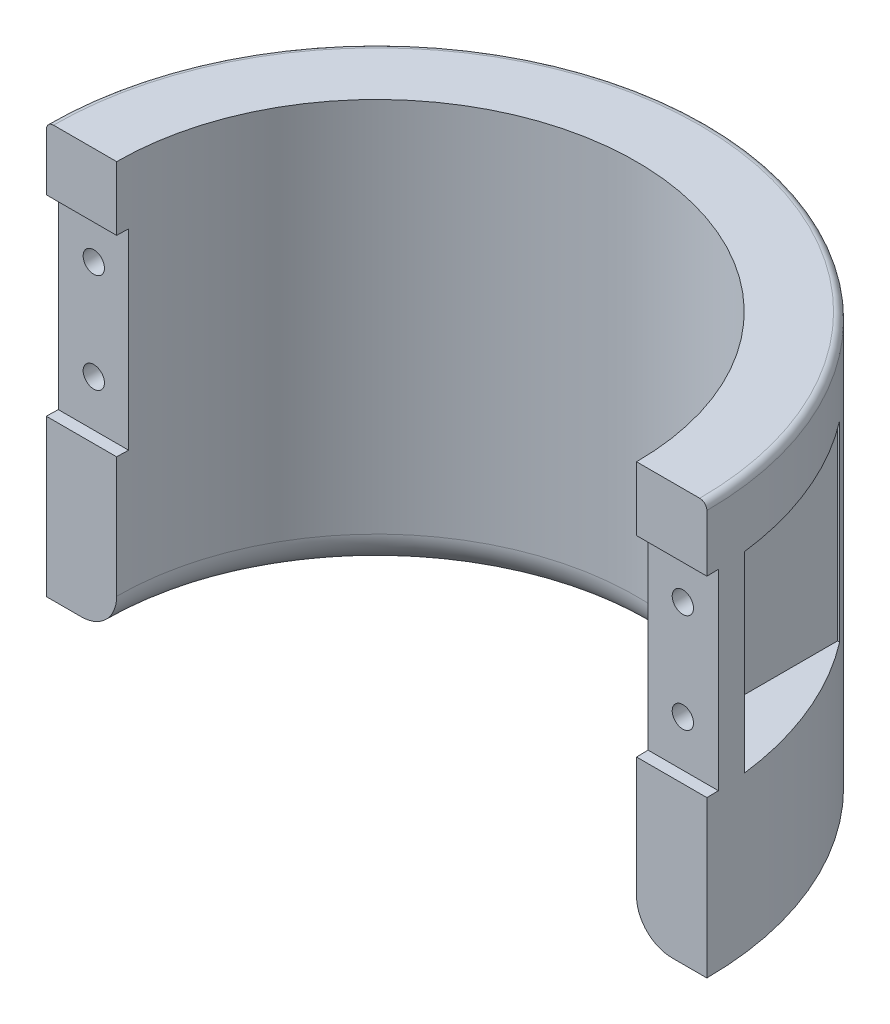
ISO-10303-21;
HEADER;
FILE_DESCRIPTION(('STEP AP214'),'2;1');
FILE_NAME('part.step','',(''),(''),'','','');
FILE_SCHEMA(('AUTOMOTIVE_DESIGN { 1 0 10303 214 1 1 1 1 }'));
ENDSEC;
DATA;
#1=APPLICATION_CONTEXT('core data for automotive mechanical design processes');
#2=APPLICATION_PROTOCOL_DEFINITION('international standard','automotive_design',2000,#1);
#3=PRODUCT_CONTEXT('',#1,'mechanical');
#4=PRODUCT('Part','Part','',(#3));
#5=PRODUCT_RELATED_PRODUCT_CATEGORY('part','',(#4));
#6=PRODUCT_DEFINITION_FORMATION('','',#4);
#7=PRODUCT_DEFINITION_CONTEXT('part definition',#1,'design');
#8=PRODUCT_DEFINITION('design','',#6,#7);
#9=PRODUCT_DEFINITION_SHAPE('','',#8);
#10=(LENGTH_UNIT() NAMED_UNIT(*) SI_UNIT(.MILLI.,.METRE.));
#11=(NAMED_UNIT(*) PLANE_ANGLE_UNIT() SI_UNIT($,.RADIAN.));
#12=(NAMED_UNIT(*) SI_UNIT($,.STERADIAN.) SOLID_ANGLE_UNIT());
#13=UNCERTAINTY_MEASURE_WITH_UNIT(LENGTH_MEASURE(1.E-05),#10,'distance_accuracy_value','');
#14=(GEOMETRIC_REPRESENTATION_CONTEXT(3) GLOBAL_UNCERTAINTY_ASSIGNED_CONTEXT((#13)) GLOBAL_UNIT_ASSIGNED_CONTEXT((#10,
#11,#12)) REPRESENTATION_CONTEXT('',''));
#15=CARTESIAN_POINT('',(0.,0.,0.));
#16=DIRECTION('',(0.,0.,1.));
#17=DIRECTION('',(1.,0.,0.));
#18=AXIS2_PLACEMENT_3D('',#15,#16,#17);
#19=CARTESIAN_POINT('',(41.4707165858242,42.5,-46.501));
#20=DIRECTION('',(0.,0.,1.));
#21=DIRECTION('',(1.,0.,0.));
#22=AXIS2_PLACEMENT_3D('',#19,#20,#21);
#23=CYLINDRICAL_SURFACE('',#22,1.5);
#24=CARTESIAN_POINT('',(41.4707165858242,42.5,-1.65));
#25=DIRECTION('',(0.,0.,-1.));
#26=DIRECTION('',(-1.,0.,0.));
#27=AXIS2_PLACEMENT_3D('',#24,#25,#26);
#28=CIRCLE('',#27,1.5);
#29=CARTESIAN_POINT('',(39.9707165858242,42.5,-1.65));
#30=VERTEX_POINT('',#29);
#31=EDGE_CURVE('E228',#30,#30,#28,.T.);
#32=ORIENTED_EDGE('',*,*,#31,.F.);
#33=EDGE_LOOP('',(#32));
#34=FACE_BOUND('',#33,.T.);
#35=CARTESIAN_POINT('',(41.4707165858242,42.5,-5.65));
#36=DIRECTION('',(0.,0.,-1.));
#37=DIRECTION('',(-1.,0.,0.));
#38=AXIS2_PLACEMENT_3D('',#35,#36,#37);
#39=CIRCLE('',#38,1.5);
#40=CARTESIAN_POINT('',(39.9707165858242,42.5,-5.65));
#41=VERTEX_POINT('',#40);
#42=EDGE_CURVE('E223',#41,#41,#39,.T.);
#43=ORIENTED_EDGE('',*,*,#42,.T.);
#44=EDGE_LOOP('',(#43));
#45=FACE_BOUND('',#44,.T.);
#46=ADVANCED_FACE('F37',(#34,#45),#23,.F.);
#47=CARTESIAN_POINT('',(41.4707165858242,28.5,-46.501));
#48=DIRECTION('',(0.,0.,1.));
#49=DIRECTION('',(1.,0.,0.));
#50=AXIS2_PLACEMENT_3D('',#47,#48,#49);
#51=CYLINDRICAL_SURFACE('',#50,1.5);
#52=CARTESIAN_POINT('',(41.4707165858242,28.5,-1.65));
#53=DIRECTION('',(0.,0.,-1.));
#54=DIRECTION('',(-1.,0.,0.));
#55=AXIS2_PLACEMENT_3D('',#52,#53,#54);
#56=CIRCLE('',#55,1.5);
#57=CARTESIAN_POINT('',(39.9707165858242,28.5,-1.65));
#58=VERTEX_POINT('',#57);
#59=EDGE_CURVE('E229',#58,#58,#56,.T.);
#60=ORIENTED_EDGE('',*,*,#59,.F.);
#61=EDGE_LOOP('',(#60));
#62=FACE_BOUND('',#61,.T.);
#63=CARTESIAN_POINT('',(41.4707165858242,28.5,-5.65));
#64=DIRECTION('',(0.,0.,-1.));
#65=DIRECTION('',(-1.,0.,0.));
#66=AXIS2_PLACEMENT_3D('',#63,#64,#65);
#67=CIRCLE('',#66,1.5);
#68=CARTESIAN_POINT('',(39.9707165858242,28.5,-5.65));
#69=VERTEX_POINT('',#68);
#70=EDGE_CURVE('E221',#69,#69,#67,.T.);
#71=ORIENTED_EDGE('',*,*,#70,.T.);
#72=EDGE_LOOP('',(#71));
#73=FACE_BOUND('',#72,.T.);
#74=ADVANCED_FACE('F414',(#62,#73),#51,.F.);
#75=CARTESIAN_POINT('',(0.,58.,0.));
#76=DIRECTION('',(0.,-1.,0.));
#77=DIRECTION('',(0.,0.,-1.));
#78=AXIS2_PLACEMENT_3D('',#75,#76,#77);
#79=CYLINDRICAL_SURFACE('',#78,46.5);
#80=CARTESIAN_POINT('',(0.,0.,0.));
#81=DIRECTION('',(0.,1.,0.));
#82=DIRECTION('',(0.,0.,1.));
#83=AXIS2_PLACEMENT_3D('',#80,#81,#82);
#84=CIRCLE('',#83,46.5);
#85=CARTESIAN_POINT('',(46.5,0.,0.));
#86=VERTEX_POINT('',#85);
#87=CARTESIAN_POINT('',(-46.5,0.,0.));
#88=VERTEX_POINT('',#87);
#89=EDGE_CURVE('E320',#86,#88,#84,.T.);
#90=ORIENTED_EDGE('',*,*,#89,.T.);
#91=DIRECTION('',(0.,-1.,0.));
#92=VECTOR('',#91,1.);
#93=CARTESIAN_POINT('',(-46.5,58.,0.));
#94=LINE('',#93,#92);
#95=CARTESIAN_POINT('',(-46.5,22.,0.));
#96=VERTEX_POINT('',#95);
#97=EDGE_CURVE('E327',#96,#88,#94,.T.);
#98=ORIENTED_EDGE('',*,*,#97,.F.);
#99=CARTESIAN_POINT('',(0.,22.,0.));
#100=DIRECTION('',(0.,-1.,0.));
#101=DIRECTION('',(0.,0.,-1.));
#102=AXIS2_PLACEMENT_3D('',#99,#100,#101);
#103=CIRCLE('',#102,46.5);
#104=CARTESIAN_POINT('',(-46.4707165858242,22.,-1.65));
#105=VERTEX_POINT('',#104);
#106=EDGE_CURVE('E292',#96,#105,#103,.T.);
#107=ORIENTED_EDGE('',*,*,#106,.T.);
#108=DIRECTION('',(0.,-1.,0.));
#109=VECTOR('',#108,1.);
#110=CARTESIAN_POINT('',(-46.4707165858242,58.,-1.65));
#111=LINE('',#110,#109);
#112=CARTESIAN_POINT('',(-46.4707165858242,49.,-1.65));
#113=VERTEX_POINT('',#112);
#114=EDGE_CURVE('E353',#105,#113,#111,.F.);
#115=ORIENTED_EDGE('',*,*,#114,.T.);
#116=CARTESIAN_POINT('',(0.,49.,0.));
#117=DIRECTION('',(0.,1.,0.));
#118=DIRECTION('',(0.,0.,1.));
#119=AXIS2_PLACEMENT_3D('',#116,#117,#118);
#120=CIRCLE('',#119,46.5);
#121=CARTESIAN_POINT('',(-46.5,49.,0.));
#122=VERTEX_POINT('',#121);
#123=EDGE_CURVE('E298',#113,#122,#120,.T.);
#124=ORIENTED_EDGE('',*,*,#123,.T.);
#125=CARTESIAN_POINT('',(-46.5,57.,0.));
#126=VERTEX_POINT('',#125);
#127=EDGE_CURVE('E328',#126,#122,#94,.T.);
#128=ORIENTED_EDGE('',*,*,#127,.F.);
#129=CARTESIAN_POINT('',(0.,57.,0.));
#130=DIRECTION('',(0.,1.,0.));
#131=DIRECTION('',(0.,0.,1.));
#132=AXIS2_PLACEMENT_3D('',#129,#130,#131);
#133=CIRCLE('',#132,46.5);
#134=CARTESIAN_POINT('',(46.5,57.,0.));
#135=VERTEX_POINT('',#134);
#136=EDGE_CURVE('E45',#126,#135,#133,.F.);
#137=ORIENTED_EDGE('',*,*,#136,.T.);
#138=DIRECTION('',(0.,-1.,0.));
#139=VECTOR('',#138,1.);
#140=CARTESIAN_POINT('',(46.5,58.,0.));
#141=LINE('',#140,#139);
#142=CARTESIAN_POINT('',(46.5,49.,0.));
#143=VERTEX_POINT('',#142);
#144=EDGE_CURVE('E331',#135,#143,#141,.T.);
#145=ORIENTED_EDGE('',*,*,#144,.T.);
#146=CARTESIAN_POINT('',(0.,49.,0.));
#147=DIRECTION('',(0.,-1.,0.));
#148=DIRECTION('',(0.,0.,-1.));
#149=AXIS2_PLACEMENT_3D('',#146,#147,#148);
#150=CIRCLE('',#149,46.5);
#151=CARTESIAN_POINT('',(46.4707165858242,49.,-1.65));
#152=VERTEX_POINT('',#151);
#153=EDGE_CURVE('E370',#152,#143,#150,.T.);
#154=ORIENTED_EDGE('',*,*,#153,.F.);
#155=DIRECTION('',(0.,-1.,0.));
#156=VECTOR('',#155,1.);
#157=CARTESIAN_POINT('',(46.4707165858242,58.,-1.65));
#158=LINE('',#157,#156);
#159=CARTESIAN_POINT('',(46.4707165858242,22.,-1.65));
#160=VERTEX_POINT('',#159);
#161=EDGE_CURVE('E367',#152,#160,#158,.T.);
#162=ORIENTED_EDGE('',*,*,#161,.T.);
#163=CARTESIAN_POINT('',(0.,22.,0.));
#164=DIRECTION('',(0.,1.,0.));
#165=DIRECTION('',(0.,0.,1.));
#166=AXIS2_PLACEMENT_3D('',#163,#164,#165);
#167=CIRCLE('',#166,46.5);
#168=CARTESIAN_POINT('',(46.5,22.,0.));
#169=VERTEX_POINT('',#168);
#170=EDGE_CURVE('E373',#169,#160,#167,.T.);
#171=ORIENTED_EDGE('',*,*,#170,.F.);
#172=EDGE_CURVE('E330',#169,#86,#141,.T.);
#173=ORIENTED_EDGE('',*,*,#172,.T.);
#174=EDGE_LOOP('',(#90,#98,#107,#115,#124,#128,#137,#145,#154,#162,#171,#173));
#175=FACE_BOUND('',#174,.T.);
#176=CARTESIAN_POINT('',(0.,49.,0.));
#177=DIRECTION('',(0.,-1.,0.));
#178=DIRECTION('',(0.,0.,-1.));
#179=AXIS2_PLACEMENT_3D('',#176,#177,#178);
#180=CIRCLE('',#179,46.5);
#181=CARTESIAN_POINT('',(36.8966123106173,49.,-28.3));
#182=VERTEX_POINT('',#181);
#183=CARTESIAN_POINT('',(46.1554709649896,49.,-5.65));
#184=VERTEX_POINT('',#183);
#185=EDGE_CURVE('E376',#182,#184,#180,.T.);
#186=ORIENTED_EDGE('',*,*,#185,.F.);
#187=DIRECTION('',(0.,-1.,0.));
#188=VECTOR('',#187,1.);
#189=CARTESIAN_POINT('',(36.8966123106173,58.,-28.3));
#190=LINE('',#189,#188);
#191=CARTESIAN_POINT('',(36.8966123106173,22.,-28.3));
#192=VERTEX_POINT('',#191);
#193=EDGE_CURVE('E208',#182,#192,#190,.T.);
#194=ORIENTED_EDGE('',*,*,#193,.T.);
#195=CARTESIAN_POINT('',(0.,22.,0.));
#196=DIRECTION('',(0.,1.,0.));
#197=DIRECTION('',(0.,0.,1.));
#198=AXIS2_PLACEMENT_3D('',#195,#196,#197);
#199=CIRCLE('',#198,46.5);
#200=CARTESIAN_POINT('',(46.1554709649896,22.,-5.65));
#201=VERTEX_POINT('',#200);
#202=EDGE_CURVE('E380',#201,#192,#199,.T.);
#203=ORIENTED_EDGE('',*,*,#202,.F.);
#204=DIRECTION('',(0.,-1.,0.));
#205=VECTOR('',#204,1.);
#206=CARTESIAN_POINT('',(46.1554709649896,58.,-5.65));
#207=LINE('',#206,#205);
#208=EDGE_CURVE('E226',#184,#201,#207,.T.);
#209=ORIENTED_EDGE('',*,*,#208,.F.);
#210=EDGE_LOOP('',(#186,#194,#203,#209));
#211=FACE_BOUND('',#210,.T.);
#212=CARTESIAN_POINT('',(0.,22.,0.));
#213=DIRECTION('',(0.,-1.,0.));
#214=DIRECTION('',(0.,0.,-1.));
#215=AXIS2_PLACEMENT_3D('',#212,#213,#214);
#216=CIRCLE('',#215,46.5);
#217=CARTESIAN_POINT('',(-46.1554709649896,22.,-5.65));
#218=VERTEX_POINT('',#217);
#219=CARTESIAN_POINT('',(-36.8966123106173,22.,-28.3));
#220=VERTEX_POINT('',#219);
#221=EDGE_CURVE('E356',#218,#220,#216,.T.);
#222=ORIENTED_EDGE('',*,*,#221,.T.);
#223=DIRECTION('',(0.,-1.,0.));
#224=VECTOR('',#223,1.);
#225=CARTESIAN_POINT('',(-36.8966123106173,58.,-28.3));
#226=LINE('',#225,#224);
#227=CARTESIAN_POINT('',(-36.8966123106173,49.,-28.3));
#228=VERTEX_POINT('',#227);
#229=EDGE_CURVE('E364',#220,#228,#226,.F.);
#230=ORIENTED_EDGE('',*,*,#229,.T.);
#231=CARTESIAN_POINT('',(0.,49.,0.));
#232=DIRECTION('',(0.,1.,0.));
#233=DIRECTION('',(0.,0.,1.));
#234=AXIS2_PLACEMENT_3D('',#231,#232,#233);
#235=CIRCLE('',#234,46.5);
#236=CARTESIAN_POINT('',(-46.1554709649896,49.,-5.65));
#237=VERTEX_POINT('',#236);
#238=EDGE_CURVE('E361',#228,#237,#235,.T.);
#239=ORIENTED_EDGE('',*,*,#238,.T.);
#240=DIRECTION('',(0.,-1.,0.));
#241=VECTOR('',#240,1.);
#242=CARTESIAN_POINT('',(-46.1554709649896,58.,-5.65));
#243=LINE('',#242,#241);
#244=EDGE_CURVE('E278',#218,#237,#243,.F.);
#245=ORIENTED_EDGE('',*,*,#244,.F.);
#246=EDGE_LOOP('',(#222,#230,#239,#245));
#247=FACE_BOUND('',#246,.T.);
#248=ADVANCED_FACE('F421',(#175,#211,#247),#79,.T.);
#249=CARTESIAN_POINT('',(0.,58.,0.));
#250=DIRECTION('',(0.,-1.,0.));
#251=DIRECTION('',(0.,0.,-1.));
#252=AXIS2_PLACEMENT_3D('',#249,#250,#251);
#253=CYLINDRICAL_SURFACE('',#252,36.6);
#254=CARTESIAN_POINT('',(0.,22.,0.));
#255=DIRECTION('',(0.,1.,0.));
#256=DIRECTION('',(0.,0.,1.));
#257=AXIS2_PLACEMENT_3D('',#254,#255,#256);
#258=CIRCLE('',#257,36.6);
#259=CARTESIAN_POINT('',(36.5627884604005,22.,-1.65));
#260=VERTEX_POINT('',#259);
#261=CARTESIAN_POINT('',(36.6,22.,0.));
#262=VERTEX_POINT('',#261);
#263=EDGE_CURVE('E251',#260,#262,#258,.F.);
#264=ORIENTED_EDGE('',*,*,#263,.F.);
#265=DIRECTION('',(0.,-1.,0.));
#266=VECTOR('',#265,1.);
#267=CARTESIAN_POINT('',(36.5627884604005,58.,-1.65));
#268=LINE('',#267,#266);
#269=CARTESIAN_POINT('',(36.5627884604005,49.,-1.65));
#270=VERTEX_POINT('',#269);
#271=EDGE_CURVE('E242',#260,#270,#268,.F.);
#272=ORIENTED_EDGE('',*,*,#271,.T.);
#273=CARTESIAN_POINT('',(0.,49.,0.));
#274=DIRECTION('',(0.,-1.,0.));
#275=DIRECTION('',(0.,0.,-1.));
#276=AXIS2_PLACEMENT_3D('',#273,#274,#275);
#277=CIRCLE('',#276,36.6);
#278=CARTESIAN_POINT('',(36.6,49.,0.));
#279=VERTEX_POINT('',#278);
#280=EDGE_CURVE('E249',#279,#270,#277,.F.);
#281=ORIENTED_EDGE('',*,*,#280,.F.);
#282=DIRECTION('',(0.,-1.,0.));
#283=VECTOR('',#282,1.);
#284=CARTESIAN_POINT('',(36.6,58.,0.));
#285=LINE('',#284,#283);
#286=CARTESIAN_POINT('',(36.6,58.,0.));
#287=VERTEX_POINT('',#286);
#288=EDGE_CURVE('E334',#287,#279,#285,.T.);
#289=ORIENTED_EDGE('',*,*,#288,.F.);
#290=CARTESIAN_POINT('',(0.,58.,0.));
#291=DIRECTION('',(0.,-1.,0.));
#292=DIRECTION('',(0.,0.,1.));
#293=AXIS2_PLACEMENT_3D('',#290,#291,#292);
#294=CIRCLE('',#293,36.6);
#295=CARTESIAN_POINT('',(-36.6,58.,0.));
#296=VERTEX_POINT('',#295);
#297=EDGE_CURVE('E308',#296,#287,#294,.T.);
#298=ORIENTED_EDGE('',*,*,#297,.F.);
#299=DIRECTION('',(0.,-1.,0.));
#300=VECTOR('',#299,1.);
#301=CARTESIAN_POINT('',(-36.6,58.,0.));
#302=LINE('',#301,#300);
#303=CARTESIAN_POINT('',(-36.6,49.,0.));
#304=VERTEX_POINT('',#303);
#305=EDGE_CURVE('E324',#296,#304,#302,.T.);
#306=ORIENTED_EDGE('',*,*,#305,.T.);
#307=CARTESIAN_POINT('',(0.,49.,0.));
#308=DIRECTION('',(0.,1.,0.));
#309=DIRECTION('',(0.,0.,1.));
#310=AXIS2_PLACEMENT_3D('',#307,#308,#309);
#311=CIRCLE('',#310,36.6);
#312=CARTESIAN_POINT('',(-36.5627884604005,49.,-1.65));
#313=VERTEX_POINT('',#312);
#314=EDGE_CURVE('E301',#304,#313,#311,.F.);
#315=ORIENTED_EDGE('',*,*,#314,.T.);
#316=DIRECTION('',(0.,-1.,0.));
#317=VECTOR('',#316,1.);
#318=CARTESIAN_POINT('',(-36.5627884604005,58.,-1.65));
#319=LINE('',#318,#317);
#320=CARTESIAN_POINT('',(-36.5627884604005,22.,-1.65));
#321=VERTEX_POINT('',#320);
#322=EDGE_CURVE('E304',#313,#321,#319,.T.);
#323=ORIENTED_EDGE('',*,*,#322,.T.);
#324=CARTESIAN_POINT('',(0.,22.,0.));
#325=DIRECTION('',(0.,-1.,0.));
#326=DIRECTION('',(0.,0.,-1.));
#327=AXIS2_PLACEMENT_3D('',#324,#325,#326);
#328=CIRCLE('',#327,36.6);
#329=CARTESIAN_POINT('',(-36.6,22.,0.));
#330=VERTEX_POINT('',#329);
#331=EDGE_CURVE('E295',#321,#330,#328,.F.);
#332=ORIENTED_EDGE('',*,*,#331,.T.);
#333=CARTESIAN_POINT('',(-36.6,5.00000000000001,0.));
#334=VERTEX_POINT('',#333);
#335=EDGE_CURVE('E317',#330,#334,#302,.T.);
#336=ORIENTED_EDGE('',*,*,#335,.T.);
#337=CARTESIAN_POINT('',(0.,5.,0.));
#338=DIRECTION('',(0.,1.,0.));
#339=DIRECTION('',(0.,0.,1.));
#340=AXIS2_PLACEMENT_3D('',#337,#338,#339);
#341=CIRCLE('',#340,36.6);
#342=CARTESIAN_POINT('',(36.6,5.00000000000001,0.));
#343=VERTEX_POINT('',#342);
#344=EDGE_CURVE('E337',#334,#343,#341,.F.);
#345=ORIENTED_EDGE('',*,*,#344,.T.);
#346=EDGE_CURVE('E333',#262,#343,#285,.T.);
#347=ORIENTED_EDGE('',*,*,#346,.F.);
#348=EDGE_LOOP('',(#264,#272,#281,#289,#298,#306,#315,#323,#332,#336,#345,#347));
#349=FACE_BOUND('',#348,.T.);
#350=ADVANCED_FACE('F398',(#349),#253,.F.);
#351=CARTESIAN_POINT('',(36.6,58.,0.));
#352=DIRECTION('',(0.,0.,-1.));
#353=DIRECTION('',(-1.,0.,0.));
#354=AXIS2_PLACEMENT_3D('',#351,#352,#353);
#355=PLANE('',#354);
#356=DIRECTION('',(-1.,0.,0.));
#357=VECTOR('',#356,1.);
#358=CARTESIAN_POINT('',(48.2491093819212,22.,0.));
#359=LINE('',#358,#357);
#360=EDGE_CURVE('E239',#169,#262,#359,.T.);
#361=ORIENTED_EDGE('',*,*,#360,.T.);
#362=ORIENTED_EDGE('',*,*,#346,.T.);
#363=CARTESIAN_POINT('',(41.6,5.,0.));
#364=DIRECTION('',(0.,0.,-1.));
#365=DIRECTION('',(-1.,0.,0.));
#366=AXIS2_PLACEMENT_3D('',#363,#364,#365);
#367=CIRCLE('',#366,5.);
#368=CARTESIAN_POINT('',(41.6,0.,0.));
#369=VERTEX_POINT('',#368);
#370=EDGE_CURVE('E340',#343,#369,#367,.F.);
#371=ORIENTED_EDGE('',*,*,#370,.T.);
#372=DIRECTION('',(1.,0.,0.));
#373=VECTOR('',#372,1.);
#374=CARTESIAN_POINT('',(36.6,0.,0.));
#375=LINE('',#374,#373);
#376=EDGE_CURVE('E307',#369,#86,#375,.T.);
#377=ORIENTED_EDGE('',*,*,#376,.T.);
#378=ORIENTED_EDGE('',*,*,#172,.F.);
#379=EDGE_LOOP('',(#361,#362,#371,#377,#378));
#380=FACE_BOUND('',#379,.T.);
#381=ADVANCED_FACE('F494',(#380),#355,.F.);
#382=ORIENTED_EDGE('',*,*,#144,.F.);
#383=CARTESIAN_POINT('',(45.5,57.,0.));
#384=DIRECTION('',(0.,0.,-1.));
#385=DIRECTION('',(-1.,0.,0.));
#386=AXIS2_PLACEMENT_3D('',#383,#384,#385);
#387=CIRCLE('',#386,1.);
#388=CARTESIAN_POINT('',(45.5,58.,0.));
#389=VERTEX_POINT('',#388);
#390=EDGE_CURVE('E11',#135,#389,#387,.F.);
#391=ORIENTED_EDGE('',*,*,#390,.T.);
#392=DIRECTION('',(1.,0.,0.));
#393=VECTOR('',#392,1.);
#394=CARTESIAN_POINT('',(36.6,58.,0.));
#395=LINE('',#394,#393);
#396=EDGE_CURVE('E311',#287,#389,#395,.T.);
#397=ORIENTED_EDGE('',*,*,#396,.F.);
#398=ORIENTED_EDGE('',*,*,#288,.T.);
#399=DIRECTION('',(1.,0.,0.));
#400=VECTOR('',#399,1.);
#401=CARTESIAN_POINT('',(48.2491093819212,49.,0.));
#402=LINE('',#401,#400);
#403=EDGE_CURVE('E232',#279,#143,#402,.T.);
#404=ORIENTED_EDGE('',*,*,#403,.T.);
#405=EDGE_LOOP('',(#382,#391,#397,#398,#404));
#406=FACE_BOUND('',#405,.T.);
#407=ADVANCED_FACE('F401',(#406),#355,.F.);
#408=CARTESIAN_POINT('',(-41.4707165858242,42.5,-46.501));
#409=DIRECTION('',(0.,0.,1.));
#410=DIRECTION('',(1.,0.,0.));
#411=AXIS2_PLACEMENT_3D('',#408,#409,#410);
#412=CYLINDRICAL_SURFACE('',#411,1.5);
#413=CARTESIAN_POINT('',(-41.4707165858242,42.5,-1.65));
#414=DIRECTION('',(0.,0.,1.));
#415=DIRECTION('',(1.,0.,0.));
#416=AXIS2_PLACEMENT_3D('',#413,#414,#415);
#417=CIRCLE('',#416,1.5);
#418=CARTESIAN_POINT('',(-39.9707165858242,42.5,-1.65));
#419=VERTEX_POINT('',#418);
#420=EDGE_CURVE('E280',#419,#419,#417,.T.);
#421=ORIENTED_EDGE('',*,*,#420,.T.);
#422=EDGE_LOOP('',(#421));
#423=FACE_BOUND('',#422,.T.);
#424=CARTESIAN_POINT('',(-41.4707165858242,42.5,-5.65));
#425=DIRECTION('',(0.,0.,-1.));
#426=DIRECTION('',(-1.,0.,0.));
#427=AXIS2_PLACEMENT_3D('',#424,#425,#426);
#428=CIRCLE('',#427,1.5);
#429=CARTESIAN_POINT('',(-42.9707165858242,42.5,-5.65));
#430=VERTEX_POINT('',#429);
#431=EDGE_CURVE('E275',#430,#430,#428,.F.);
#432=ORIENTED_EDGE('',*,*,#431,.F.);
#433=EDGE_LOOP('',(#432));
#434=FACE_BOUND('',#433,.T.);
#435=ADVANCED_FACE('F465',(#423,#434),#412,.F.);
#436=CARTESIAN_POINT('',(-41.4707165858242,28.5,-46.501));
#437=DIRECTION('',(0.,0.,1.));
#438=DIRECTION('',(1.,0.,0.));
#439=AXIS2_PLACEMENT_3D('',#436,#437,#438);
#440=CYLINDRICAL_SURFACE('',#439,1.5);
#441=CARTESIAN_POINT('',(-41.4707165858242,28.5,-1.65));
#442=DIRECTION('',(0.,0.,1.));
#443=DIRECTION('',(1.,0.,0.));
#444=AXIS2_PLACEMENT_3D('',#441,#442,#443);
#445=CIRCLE('',#444,1.5);
#446=CARTESIAN_POINT('',(-39.9707165858242,28.5,-1.65));
#447=VERTEX_POINT('',#446);
#448=EDGE_CURVE('E281',#447,#447,#445,.T.);
#449=ORIENTED_EDGE('',*,*,#448,.T.);
#450=EDGE_LOOP('',(#449));
#451=FACE_BOUND('',#450,.T.);
#452=CARTESIAN_POINT('',(-41.4707165858242,28.5,-5.65));
#453=DIRECTION('',(0.,0.,-1.));
#454=DIRECTION('',(-1.,0.,0.));
#455=AXIS2_PLACEMENT_3D('',#452,#453,#454);
#456=CIRCLE('',#455,1.5);
#457=CARTESIAN_POINT('',(-42.9707165858242,28.5,-5.65));
#458=VERTEX_POINT('',#457);
#459=EDGE_CURVE('E272',#458,#458,#456,.F.);
#460=ORIENTED_EDGE('',*,*,#459,.F.);
#461=EDGE_LOOP('',(#460));
#462=FACE_BOUND('',#461,.T.);
#463=ADVANCED_FACE('F462',(#451,#462),#440,.F.);
#464=CARTESIAN_POINT('',(-46.5,58.,0.));
#465=DIRECTION('',(0.,0.,-1.));
#466=DIRECTION('',(-1.,0.,0.));
#467=AXIS2_PLACEMENT_3D('',#464,#465,#466);
#468=PLANE('',#467);
#469=DIRECTION('',(1.,0.,0.));
#470=VECTOR('',#469,1.);
#471=CARTESIAN_POINT('',(-46.5,58.,0.));
#472=LINE('',#471,#470);
#473=CARTESIAN_POINT('',(-45.5,58.,0.));
#474=VERTEX_POINT('',#473);
#475=EDGE_CURVE('E315',#474,#296,#472,.T.);
#476=ORIENTED_EDGE('',*,*,#475,.F.);
#477=CARTESIAN_POINT('',(-45.5,57.,0.));
#478=DIRECTION('',(0.,0.,-1.));
#479=DIRECTION('',(-1.,0.,0.));
#480=AXIS2_PLACEMENT_3D('',#477,#478,#479);
#481=CIRCLE('',#480,1.);
#482=EDGE_CURVE('E59',#474,#126,#481,.F.);
#483=ORIENTED_EDGE('',*,*,#482,.T.);
#484=ORIENTED_EDGE('',*,*,#127,.T.);
#485=DIRECTION('',(1.,0.,0.));
#486=VECTOR('',#485,1.);
#487=CARTESIAN_POINT('',(-46.5,49.,0.));
#488=LINE('',#487,#486);
#489=EDGE_CURVE('E350',#122,#304,#488,.T.);
#490=ORIENTED_EDGE('',*,*,#489,.T.);
#491=ORIENTED_EDGE('',*,*,#305,.F.);
#492=EDGE_LOOP('',(#476,#483,#484,#490,#491));
#493=FACE_BOUND('',#492,.T.);
#494=ADVANCED_FACE('F392',(#493),#468,.F.);
#495=ORIENTED_EDGE('',*,*,#335,.F.);
#496=DIRECTION('',(-1.,0.,0.));
#497=VECTOR('',#496,1.);
#498=CARTESIAN_POINT('',(-46.5,22.,0.));
#499=LINE('',#498,#497);
#500=EDGE_CURVE('E347',#330,#96,#499,.T.);
#501=ORIENTED_EDGE('',*,*,#500,.T.);
#502=ORIENTED_EDGE('',*,*,#97,.T.);
#503=DIRECTION('',(1.,0.,0.));
#504=VECTOR('',#503,1.);
#505=CARTESIAN_POINT('',(-46.5,0.,0.));
#506=LINE('',#505,#504);
#507=CARTESIAN_POINT('',(-41.6,0.,0.));
#508=VERTEX_POINT('',#507);
#509=EDGE_CURVE('E312',#88,#508,#506,.T.);
#510=ORIENTED_EDGE('',*,*,#509,.T.);
#511=CARTESIAN_POINT('',(-41.6,5.,0.));
#512=DIRECTION('',(0.,0.,-1.));
#513=DIRECTION('',(-1.,0.,0.));
#514=AXIS2_PLACEMENT_3D('',#511,#512,#513);
#515=CIRCLE('',#514,5.);
#516=EDGE_CURVE('E344',#508,#334,#515,.F.);
#517=ORIENTED_EDGE('',*,*,#516,.T.);
#518=EDGE_LOOP('',(#495,#501,#502,#510,#517));
#519=FACE_BOUND('',#518,.T.);
#520=ADVANCED_FACE('F485',(#519),#468,.F.);
#521=CARTESIAN_POINT('',(0.,58.,0.));
#522=DIRECTION('',(0.,1.,0.));
#523=DIRECTION('',(0.,0.,1.));
#524=AXIS2_PLACEMENT_3D('',#521,#522,#523);
#525=PLANE('',#524);
#526=ORIENTED_EDGE('',*,*,#396,.T.);
#527=CARTESIAN_POINT('',(0.,58.,0.));
#528=DIRECTION('',(0.,1.,0.));
#529=DIRECTION('',(0.,0.,1.));
#530=AXIS2_PLACEMENT_3D('',#527,#528,#529);
#531=CIRCLE('',#530,45.5);
#532=EDGE_CURVE('E383',#389,#474,#531,.T.);
#533=ORIENTED_EDGE('',*,*,#532,.T.);
#534=ORIENTED_EDGE('',*,*,#475,.T.);
#535=ORIENTED_EDGE('',*,*,#297,.T.);
#536=EDGE_LOOP('',(#526,#533,#534,#535));
#537=FACE_BOUND('',#536,.T.);
#538=ADVANCED_FACE('F388',(#537),#525,.T.);
#539=CARTESIAN_POINT('',(0.,0.,0.));
#540=DIRECTION('',(0.,1.,0.));
#541=DIRECTION('',(0.,0.,1.));
#542=AXIS2_PLACEMENT_3D('',#539,#540,#541);
#543=PLANE('',#542);
#544=CARTESIAN_POINT('',(-42.3220149751344,0.,-13.751256249685));
#545=DIRECTION('',(0.,-1.,0.));
#546=DIRECTION('',(-0.951056516295155,0.,-0.309016994374945));
#547=AXIS2_PLACEMENT_3D('',#544,#545,#546);
#548=CIRCLE('',#547,1.);
#549=CARTESIAN_POINT('',(-43.2730714914295,0.,-14.06027324406));
#550=VERTEX_POINT('',#549);
#551=EDGE_CURVE('E573',#550,#550,#548,.T.);
#552=ORIENTED_EDGE('',*,*,#551,.F.);
#553=EDGE_LOOP('',(#552));
#554=FACE_BOUND('',#553,.T.);
#555=CARTESIAN_POINT('',(42.3220149751342,0.,-13.7512562496856));
#556=DIRECTION('',(0.,-1.,0.));
#557=DIRECTION('',(0.95105651629515,0.,-0.309016994374958));
#558=AXIS2_PLACEMENT_3D('',#555,#556,#557);
#559=CIRCLE('',#558,1.);
#560=CARTESIAN_POINT('',(43.2730714914293,0.,-14.0602732440606));
#561=VERTEX_POINT('',#560);
#562=EDGE_CURVE('E582',#561,#561,#559,.T.);
#563=ORIENTED_EDGE('',*,*,#562,.F.);
#564=EDGE_LOOP('',(#563));
#565=FACE_BOUND('',#564,.T.);
#566=CARTESIAN_POINT('',(0.,0.,-44.5));
#567=DIRECTION('',(0.,-1.,0.));
#568=DIRECTION('',(0.,0.,-1.));
#569=AXIS2_PLACEMENT_3D('',#566,#567,#568);
#570=CIRCLE('',#569,1.);
#571=CARTESIAN_POINT('',(0.,0.,-45.5));
#572=VERTEX_POINT('',#571);
#573=EDGE_CURVE('E214',#572,#572,#570,.T.);
#574=ORIENTED_EDGE('',*,*,#573,.F.);
#575=EDGE_LOOP('',(#574));
#576=FACE_BOUND('',#575,.T.);
#577=ORIENTED_EDGE('',*,*,#509,.F.);
#578=ORIENTED_EDGE('',*,*,#89,.F.);
#579=ORIENTED_EDGE('',*,*,#376,.F.);
#580=CARTESIAN_POINT('',(0.,0.,0.));
#581=DIRECTION('',(0.,1.,0.));
#582=DIRECTION('',(0.,0.,1.));
#583=AXIS2_PLACEMENT_3D('',#580,#581,#582);
#584=CIRCLE('',#583,41.6);
#585=EDGE_CURVE('E342',#369,#508,#584,.T.);
#586=ORIENTED_EDGE('',*,*,#585,.T.);
#587=EDGE_LOOP('',(#577,#578,#579,#586));
#588=FACE_BOUND('',#587,.T.);
#589=ADVANCED_FACE('F484',(#554,#565,#576,#588),#543,.F.);
#590=CARTESIAN_POINT('',(0.,5.,0.));
#591=DIRECTION('',(0.,1.,0.));
#592=DIRECTION('',(0.,0.,1.));
#593=AXIS2_PLACEMENT_3D('',#590,#591,#592);
#594=TOROIDAL_SURFACE('',#593,41.6,5.);
#595=ORIENTED_EDGE('',*,*,#516,.F.);
#596=ORIENTED_EDGE('',*,*,#585,.F.);
#597=ORIENTED_EDGE('',*,*,#370,.F.);
#598=ORIENTED_EDGE('',*,*,#344,.F.);
#599=EDGE_LOOP('',(#595,#596,#597,#598));
#600=FACE_BOUND('',#599,.T.);
#601=ADVANCED_FACE('F474',(#600),#594,.T.);
#602=CARTESIAN_POINT('',(0.,0.,-1.65));
#603=DIRECTION('',(0.,0.,-1.));
#604=DIRECTION('',(-1.,0.,0.));
#605=AXIS2_PLACEMENT_3D('',#602,#603,#604);
#606=PLANE('',#605);
#607=ORIENTED_EDGE('',*,*,#448,.F.);
#608=EDGE_LOOP('',(#607));
#609=FACE_BOUND('',#608,.T.);
#610=ORIENTED_EDGE('',*,*,#420,.F.);
#611=EDGE_LOOP('',(#610));
#612=FACE_BOUND('',#611,.T.);
#613=DIRECTION('',(-1.,0.,0.));
#614=VECTOR('',#613,1.);
#615=CARTESIAN_POINT('',(-48.2491093819212,49.,-1.65));
#616=LINE('',#615,#614);
#617=EDGE_CURVE('E289',#313,#113,#616,.T.);
#618=ORIENTED_EDGE('',*,*,#617,.T.);
#619=ORIENTED_EDGE('',*,*,#114,.F.);
#620=DIRECTION('',(1.,0.,0.));
#621=VECTOR('',#620,1.);
#622=CARTESIAN_POINT('',(-48.2491093819212,22.,-1.65));
#623=LINE('',#622,#621);
#624=EDGE_CURVE('E284',#105,#321,#623,.T.);
#625=ORIENTED_EDGE('',*,*,#624,.T.);
#626=ORIENTED_EDGE('',*,*,#322,.F.);
#627=EDGE_LOOP('',(#618,#619,#625,#626));
#628=FACE_BOUND('',#627,.T.);
#629=ADVANCED_FACE('F470',(#609,#612,#628),#606,.F.);
#630=CARTESIAN_POINT('',(-48.2491093819212,49.,-1.65));
#631=DIRECTION('',(0.,1.,0.));
#632=DIRECTION('',(0.,0.,1.));
#633=AXIS2_PLACEMENT_3D('',#630,#631,#632);
#634=PLANE('',#633);
#635=ORIENTED_EDGE('',*,*,#489,.F.);
#636=ORIENTED_EDGE('',*,*,#123,.F.);
#637=ORIENTED_EDGE('',*,*,#617,.F.);
#638=ORIENTED_EDGE('',*,*,#314,.F.);
#639=EDGE_LOOP('',(#635,#636,#637,#638));
#640=FACE_BOUND('',#639,.T.);
#641=ADVANCED_FACE('F473',(#640),#634,.F.);
#642=CARTESIAN_POINT('',(-48.2491093819212,22.,-1.65));
#643=DIRECTION('',(0.,-1.,0.));
#644=DIRECTION('',(0.,0.,-1.));
#645=AXIS2_PLACEMENT_3D('',#642,#643,#644);
#646=PLANE('',#645);
#647=ORIENTED_EDGE('',*,*,#624,.F.);
#648=ORIENTED_EDGE('',*,*,#106,.F.);
#649=ORIENTED_EDGE('',*,*,#500,.F.);
#650=ORIENTED_EDGE('',*,*,#331,.F.);
#651=EDGE_LOOP('',(#647,#648,#649,#650));
#652=FACE_BOUND('',#651,.T.);
#653=ADVANCED_FACE('F454',(#652),#646,.F.);
#654=CARTESIAN_POINT('',(-46.5,49.,-28.3));
#655=DIRECTION('',(0.,1.,0.));
#656=DIRECTION('',(0.,0.,1.));
#657=AXIS2_PLACEMENT_3D('',#654,#655,#656);
#658=PLANE('',#657);
#659=DIRECTION('',(-1.,0.,0.));
#660=VECTOR('',#659,1.);
#661=CARTESIAN_POINT('',(-46.5,49.,-28.3));
#662=LINE('',#661,#660);
#663=CARTESIAN_POINT('',(-36.6,49.,-28.3));
#664=VERTEX_POINT('',#663);
#665=EDGE_CURVE('E260',#664,#228,#662,.T.);
#666=ORIENTED_EDGE('',*,*,#665,.F.);
#667=DIRECTION('',(0.,0.,1.));
#668=VECTOR('',#667,1.);
#669=CARTESIAN_POINT('',(-36.6,49.,-28.3));
#670=LINE('',#669,#668);
#671=CARTESIAN_POINT('',(-36.6,49.,-5.65));
#672=VERTEX_POINT('',#671);
#673=EDGE_CURVE('E270',#664,#672,#670,.T.);
#674=ORIENTED_EDGE('',*,*,#673,.T.);
#675=DIRECTION('',(-1.,0.,0.));
#676=VECTOR('',#675,1.);
#677=CARTESIAN_POINT('',(-46.5,49.,-5.65));
#678=LINE('',#677,#676);
#679=EDGE_CURVE('E257',#672,#237,#678,.T.);
#680=ORIENTED_EDGE('',*,*,#679,.T.);
#681=ORIENTED_EDGE('',*,*,#238,.F.);
#682=EDGE_LOOP('',(#666,#674,#680,#681));
#683=FACE_BOUND('',#682,.T.);
#684=ADVANCED_FACE('F451',(#683),#658,.F.);
#685=CARTESIAN_POINT('',(-46.5,22.,-28.3));
#686=DIRECTION('',(0.,-1.,0.));
#687=DIRECTION('',(0.,0.,-1.));
#688=AXIS2_PLACEMENT_3D('',#685,#686,#687);
#689=PLANE('',#688);
#690=DIRECTION('',(1.,0.,0.));
#691=VECTOR('',#690,1.);
#692=CARTESIAN_POINT('',(-46.5,22.,-5.65));
#693=LINE('',#692,#691);
#694=CARTESIAN_POINT('',(-36.6,22.,-5.65));
#695=VERTEX_POINT('',#694);
#696=EDGE_CURVE('E253',#218,#695,#693,.T.);
#697=ORIENTED_EDGE('',*,*,#696,.T.);
#698=DIRECTION('',(0.,0.,1.));
#699=VECTOR('',#698,1.);
#700=CARTESIAN_POINT('',(-36.6,22.,-28.3));
#701=LINE('',#700,#699);
#702=CARTESIAN_POINT('',(-36.6,22.,-28.3));
#703=VERTEX_POINT('',#702);
#704=EDGE_CURVE('E263',#703,#695,#701,.T.);
#705=ORIENTED_EDGE('',*,*,#704,.F.);
#706=DIRECTION('',(1.,0.,0.));
#707=VECTOR('',#706,1.);
#708=CARTESIAN_POINT('',(-46.5,22.,-28.3));
#709=LINE('',#708,#707);
#710=EDGE_CURVE('E254',#220,#703,#709,.T.);
#711=ORIENTED_EDGE('',*,*,#710,.F.);
#712=ORIENTED_EDGE('',*,*,#221,.F.);
#713=EDGE_LOOP('',(#697,#705,#711,#712));
#714=FACE_BOUND('',#713,.T.);
#715=ADVANCED_FACE('F446',(#714),#689,.F.);
#716=CARTESIAN_POINT('',(0.,0.,-28.3));
#717=DIRECTION('',(0.,0.,-1.));
#718=DIRECTION('',(-1.,0.,0.));
#719=AXIS2_PLACEMENT_3D('',#716,#717,#718);
#720=PLANE('',#719);
#721=ORIENTED_EDGE('',*,*,#710,.T.);
#722=DIRECTION('',(0.,1.,0.));
#723=VECTOR('',#722,1.);
#724=CARTESIAN_POINT('',(-36.6,22.,-28.3));
#725=LINE('',#724,#723);
#726=EDGE_CURVE('E256',#703,#664,#725,.T.);
#727=ORIENTED_EDGE('',*,*,#726,.T.);
#728=ORIENTED_EDGE('',*,*,#665,.T.);
#729=ORIENTED_EDGE('',*,*,#229,.F.);
#730=EDGE_LOOP('',(#721,#727,#728,#729));
#731=FACE_BOUND('',#730,.T.);
#732=ADVANCED_FACE('F442',(#731),#720,.F.);
#733=CARTESIAN_POINT('',(0.,0.,-5.65));
#734=DIRECTION('',(0.,0.,-1.));
#735=DIRECTION('',(-1.,0.,0.));
#736=AXIS2_PLACEMENT_3D('',#733,#734,#735);
#737=PLANE('',#736);
#738=ORIENTED_EDGE('',*,*,#431,.T.);
#739=EDGE_LOOP('',(#738));
#740=FACE_BOUND('',#739,.T.);
#741=ORIENTED_EDGE('',*,*,#459,.T.);
#742=EDGE_LOOP('',(#741));
#743=FACE_BOUND('',#742,.T.);
#744=ORIENTED_EDGE('',*,*,#244,.T.);
#745=ORIENTED_EDGE('',*,*,#679,.F.);
#746=DIRECTION('',(0.,1.,0.));
#747=VECTOR('',#746,1.);
#748=CARTESIAN_POINT('',(-36.6,22.,-5.65));
#749=LINE('',#748,#747);
#750=EDGE_CURVE('E265',#695,#672,#749,.T.);
#751=ORIENTED_EDGE('',*,*,#750,.F.);
#752=ORIENTED_EDGE('',*,*,#696,.F.);
#753=EDGE_LOOP('',(#744,#745,#751,#752));
#754=FACE_BOUND('',#753,.T.);
#755=ADVANCED_FACE('F445',(#740,#743,#754),#737,.T.);
#756=CARTESIAN_POINT('',(-36.6,22.,-28.3));
#757=DIRECTION('',(1.,0.,0.));
#758=DIRECTION('',(0.,0.,-1.));
#759=AXIS2_PLACEMENT_3D('',#756,#757,#758);
#760=PLANE('',#759);
#761=ORIENTED_EDGE('',*,*,#750,.T.);
#762=ORIENTED_EDGE('',*,*,#673,.F.);
#763=ORIENTED_EDGE('',*,*,#726,.F.);
#764=ORIENTED_EDGE('',*,*,#704,.T.);
#765=EDGE_LOOP('',(#761,#762,#763,#764));
#766=FACE_BOUND('',#765,.T.);
#767=ADVANCED_FACE('F437',(#766),#760,.F.);
#768=CARTESIAN_POINT('',(48.2491093819212,22.,-1.65));
#769=DIRECTION('',(0.,1.,0.));
#770=DIRECTION('',(0.,0.,1.));
#771=AXIS2_PLACEMENT_3D('',#768,#769,#770);
#772=PLANE('',#771);
#773=ORIENTED_EDGE('',*,*,#263,.T.);
#774=ORIENTED_EDGE('',*,*,#360,.F.);
#775=ORIENTED_EDGE('',*,*,#170,.T.);
#776=DIRECTION('',(-1.,0.,0.));
#777=VECTOR('',#776,1.);
#778=CARTESIAN_POINT('',(48.2491093819212,22.,-1.65));
#779=LINE('',#778,#777);
#780=EDGE_CURVE('E238',#160,#260,#779,.T.);
#781=ORIENTED_EDGE('',*,*,#780,.T.);
#782=EDGE_LOOP('',(#773,#774,#775,#781));
#783=FACE_BOUND('',#782,.T.);
#784=ADVANCED_FACE('F434',(#783),#772,.T.);
#785=CARTESIAN_POINT('',(48.2491093819212,49.,-1.65));
#786=DIRECTION('',(0.,-1.,0.));
#787=DIRECTION('',(0.,0.,-1.));
#788=AXIS2_PLACEMENT_3D('',#785,#786,#787);
#789=PLANE('',#788);
#790=ORIENTED_EDGE('',*,*,#280,.T.);
#791=DIRECTION('',(1.,0.,0.));
#792=VECTOR('',#791,1.);
#793=CARTESIAN_POINT('',(48.2491093819212,49.,-1.65));
#794=LINE('',#793,#792);
#795=EDGE_CURVE('E235',#270,#152,#794,.T.);
#796=ORIENTED_EDGE('',*,*,#795,.T.);
#797=ORIENTED_EDGE('',*,*,#153,.T.);
#798=ORIENTED_EDGE('',*,*,#403,.F.);
#799=EDGE_LOOP('',(#790,#796,#797,#798));
#800=FACE_BOUND('',#799,.T.);
#801=ADVANCED_FACE('F432',(#800),#789,.T.);
#802=CARTESIAN_POINT('',(0.,0.,-1.65));
#803=DIRECTION('',(0.,0.,-1.));
#804=DIRECTION('',(1.,0.,0.));
#805=AXIS2_PLACEMENT_3D('',#802,#803,#804);
#806=PLANE('',#805);
#807=ORIENTED_EDGE('',*,*,#59,.T.);
#808=EDGE_LOOP('',(#807));
#809=FACE_BOUND('',#808,.T.);
#810=ORIENTED_EDGE('',*,*,#31,.T.);
#811=EDGE_LOOP('',(#810));
#812=FACE_BOUND('',#811,.T.);
#813=ORIENTED_EDGE('',*,*,#780,.F.);
#814=ORIENTED_EDGE('',*,*,#161,.F.);
#815=ORIENTED_EDGE('',*,*,#795,.F.);
#816=ORIENTED_EDGE('',*,*,#271,.F.);
#817=EDGE_LOOP('',(#813,#814,#815,#816));
#818=FACE_BOUND('',#817,.T.);
#819=ADVANCED_FACE('F428',(#809,#812,#818),#806,.F.);
#820=CARTESIAN_POINT('',(46.5,22.,-28.3));
#821=DIRECTION('',(0.,1.,0.));
#822=DIRECTION('',(0.,0.,1.));
#823=AXIS2_PLACEMENT_3D('',#820,#821,#822);
#824=PLANE('',#823);
#825=ORIENTED_EDGE('',*,*,#202,.T.);
#826=DIRECTION('',(-1.,0.,0.));
#827=VECTOR('',#826,1.);
#828=CARTESIAN_POINT('',(46.5,22.,-28.3));
#829=LINE('',#828,#827);
#830=CARTESIAN_POINT('',(36.6,22.,-28.3));
#831=VERTEX_POINT('',#830);
#832=EDGE_CURVE('E196',#192,#831,#829,.T.);
#833=ORIENTED_EDGE('',*,*,#832,.T.);
#834=DIRECTION('',(0.,0.,1.));
#835=VECTOR('',#834,1.);
#836=CARTESIAN_POINT('',(36.6,22.,-28.3));
#837=LINE('',#836,#835);
#838=CARTESIAN_POINT('',(36.6,22.,-5.65));
#839=VERTEX_POINT('',#838);
#840=EDGE_CURVE('E192',#831,#839,#837,.T.);
#841=ORIENTED_EDGE('',*,*,#840,.T.);
#842=DIRECTION('',(-1.,0.,0.));
#843=VECTOR('',#842,1.);
#844=CARTESIAN_POINT('',(46.5,22.,-5.65));
#845=LINE('',#844,#843);
#846=EDGE_CURVE('E209',#201,#839,#845,.T.);
#847=ORIENTED_EDGE('',*,*,#846,.F.);
#848=EDGE_LOOP('',(#825,#833,#841,#847));
#849=FACE_BOUND('',#848,.T.);
#850=ADVANCED_FACE('F431',(#849),#824,.T.);
#851=CARTESIAN_POINT('',(46.5,49.,-28.3));
#852=DIRECTION('',(0.,-1.,0.));
#853=DIRECTION('',(0.,0.,-1.));
#854=AXIS2_PLACEMENT_3D('',#851,#852,#853);
#855=PLANE('',#854);
#856=ORIENTED_EDGE('',*,*,#185,.T.);
#857=DIRECTION('',(1.,0.,0.));
#858=VECTOR('',#857,1.);
#859=CARTESIAN_POINT('',(46.5,49.,-5.65));
#860=LINE('',#859,#858);
#861=CARTESIAN_POINT('',(36.6,49.,-5.65));
#862=VERTEX_POINT('',#861);
#863=EDGE_CURVE('E204',#862,#184,#860,.T.);
#864=ORIENTED_EDGE('',*,*,#863,.F.);
#865=DIRECTION('',(0.,0.,1.));
#866=VECTOR('',#865,1.);
#867=CARTESIAN_POINT('',(36.6,49.,-28.3));
#868=LINE('',#867,#866);
#869=CARTESIAN_POINT('',(36.6,49.,-28.3));
#870=VERTEX_POINT('',#869);
#871=EDGE_CURVE('E189',#870,#862,#868,.T.);
#872=ORIENTED_EDGE('',*,*,#871,.F.);
#873=DIRECTION('',(1.,0.,0.));
#874=VECTOR('',#873,1.);
#875=CARTESIAN_POINT('',(46.5,49.,-28.3));
#876=LINE('',#875,#874);
#877=EDGE_CURVE('E197',#870,#182,#876,.T.);
#878=ORIENTED_EDGE('',*,*,#877,.T.);
#879=EDGE_LOOP('',(#856,#864,#872,#878));
#880=FACE_BOUND('',#879,.T.);
#881=ADVANCED_FACE('F202',(#880),#855,.T.);
#882=CARTESIAN_POINT('',(0.,0.,-28.3));
#883=DIRECTION('',(0.,0.,-1.));
#884=DIRECTION('',(1.,0.,0.));
#885=AXIS2_PLACEMENT_3D('',#882,#883,#884);
#886=PLANE('',#885);
#887=ORIENTED_EDGE('',*,*,#877,.F.);
#888=DIRECTION('',(0.,1.,0.));
#889=VECTOR('',#888,1.);
#890=CARTESIAN_POINT('',(36.6,22.,-28.3));
#891=LINE('',#890,#889);
#892=EDGE_CURVE('E185',#831,#870,#891,.T.);
#893=ORIENTED_EDGE('',*,*,#892,.F.);
#894=ORIENTED_EDGE('',*,*,#832,.F.);
#895=ORIENTED_EDGE('',*,*,#193,.F.);
#896=EDGE_LOOP('',(#887,#893,#894,#895));
#897=FACE_BOUND('',#896,.T.);
#898=ADVANCED_FACE('F206',(#897),#886,.F.);
#899=CARTESIAN_POINT('',(0.,0.,-5.65));
#900=DIRECTION('',(0.,0.,-1.));
#901=DIRECTION('',(1.,0.,0.));
#902=AXIS2_PLACEMENT_3D('',#899,#900,#901);
#903=PLANE('',#902);
#904=ORIENTED_EDGE('',*,*,#70,.F.);
#905=EDGE_LOOP('',(#904));
#906=FACE_BOUND('',#905,.T.);
#907=ORIENTED_EDGE('',*,*,#42,.F.);
#908=EDGE_LOOP('',(#907));
#909=FACE_BOUND('',#908,.T.);
#910=ORIENTED_EDGE('',*,*,#208,.T.);
#911=ORIENTED_EDGE('',*,*,#846,.T.);
#912=DIRECTION('',(0.,1.,0.));
#913=VECTOR('',#912,1.);
#914=CARTESIAN_POINT('',(36.6,22.,-5.65));
#915=LINE('',#914,#913);
#916=EDGE_CURVE('E211',#839,#862,#915,.T.);
#917=ORIENTED_EDGE('',*,*,#916,.T.);
#918=ORIENTED_EDGE('',*,*,#863,.T.);
#919=EDGE_LOOP('',(#910,#911,#917,#918));
#920=FACE_BOUND('',#919,.T.);
#921=ADVANCED_FACE('F411',(#906,#909,#920),#903,.T.);
#922=CARTESIAN_POINT('',(36.6,22.,-28.3));
#923=DIRECTION('',(1.,0.,0.));
#924=DIRECTION('',(0.,0.,-1.));
#925=AXIS2_PLACEMENT_3D('',#922,#923,#924);
#926=PLANE('',#925);
#927=ORIENTED_EDGE('',*,*,#916,.F.);
#928=ORIENTED_EDGE('',*,*,#840,.F.);
#929=ORIENTED_EDGE('',*,*,#892,.T.);
#930=ORIENTED_EDGE('',*,*,#871,.T.);
#931=EDGE_LOOP('',(#927,#928,#929,#930));
#932=FACE_BOUND('',#931,.T.);
#933=ADVANCED_FACE('F188',(#932),#926,.T.);
#934=CARTESIAN_POINT('',(0.,57.,0.));
#935=DIRECTION('',(0.,1.,0.));
#936=DIRECTION('',(0.,0.,1.));
#937=AXIS2_PLACEMENT_3D('',#934,#935,#936);
#938=TOROIDAL_SURFACE('',#937,45.5,1.);
#939=ORIENTED_EDGE('',*,*,#390,.F.);
#940=ORIENTED_EDGE('',*,*,#136,.F.);
#941=ORIENTED_EDGE('',*,*,#482,.F.);
#942=ORIENTED_EDGE('',*,*,#532,.F.);
#943=EDGE_LOOP('',(#939,#940,#941,#942));
#944=FACE_BOUND('',#943,.T.);
#945=ADVANCED_FACE('F39',(#944),#938,.T.);
#946=CARTESIAN_POINT('',(0.,2.,-44.5));
#947=DIRECTION('',(0.,-1.,0.));
#948=DIRECTION('',(0.,0.,-1.));
#949=AXIS2_PLACEMENT_3D('',#946,#947,#948);
#950=CYLINDRICAL_SURFACE('',#949,1.);
#951=CARTESIAN_POINT('',(0.,2.,-44.5));
#952=DIRECTION('',(0.,-1.,0.));
#953=DIRECTION('',(0.,0.,-1.));
#954=AXIS2_PLACEMENT_3D('',#951,#952,#953);
#955=CIRCLE('',#954,1.);
#956=CARTESIAN_POINT('',(0.,2.,-45.5));
#957=VERTEX_POINT('',#956);
#958=EDGE_CURVE('E219',#957,#957,#955,.T.);
#959=ORIENTED_EDGE('',*,*,#958,.F.);
#960=EDGE_LOOP('',(#959));
#961=FACE_BOUND('',#960,.T.);
#962=ORIENTED_EDGE('',*,*,#573,.T.);
#963=EDGE_LOOP('',(#962));
#964=FACE_BOUND('',#963,.T.);
#965=ADVANCED_FACE('F403',(#961,#964),#950,.F.);
#966=CARTESIAN_POINT('',(0.,2.,-44.5));
#967=DIRECTION('',(0.,-1.,0.));
#968=DIRECTION('',(0.,0.,-1.));
#969=AXIS2_PLACEMENT_3D('',#966,#967,#968);
#970=PLANE('',#969);
#971=ORIENTED_EDGE('',*,*,#958,.T.);
#972=EDGE_LOOP('',(#971));
#973=FACE_BOUND('',#972,.T.);
#974=ADVANCED_FACE('F408',(#973),#970,.T.);
#975=CARTESIAN_POINT('',(42.3220149751342,2.,-13.7512562496856));
#976=DIRECTION('',(0.,-1.,0.));
#977=DIRECTION('',(0.,0.,-1.));
#978=AXIS2_PLACEMENT_3D('',#975,#976,#977);
#979=CYLINDRICAL_SURFACE('',#978,1.);
#980=CARTESIAN_POINT('',(42.3220149751342,2.,-13.7512562496856));
#981=DIRECTION('',(0.,-1.,0.));
#982=DIRECTION('',(0.95105651629515,0.,-0.309016994374958));
#983=AXIS2_PLACEMENT_3D('',#980,#981,#982);
#984=CIRCLE('',#983,1.);
#985=CARTESIAN_POINT('',(43.2730714914293,2.,-14.0602732440606));
#986=VERTEX_POINT('',#985);
#987=EDGE_CURVE('E577',#986,#986,#984,.T.);
#988=ORIENTED_EDGE('',*,*,#987,.F.);
#989=EDGE_LOOP('',(#988));
#990=FACE_BOUND('',#989,.T.);
#991=ORIENTED_EDGE('',*,*,#562,.T.);
#992=EDGE_LOOP('',(#991));
#993=FACE_BOUND('',#992,.T.);
#994=ADVANCED_FACE('F552',(#990,#993),#979,.F.);
#995=CARTESIAN_POINT('',(42.3220149751342,2.,-13.7512562496856));
#996=DIRECTION('',(0.,-1.,0.));
#997=DIRECTION('',(0.95105651629515,0.,-0.309016994374958));
#998=AXIS2_PLACEMENT_3D('',#995,#996,#997);
#999=PLANE('',#998);
#1000=ORIENTED_EDGE('',*,*,#987,.T.);
#1001=EDGE_LOOP('',(#1000));
#1002=FACE_BOUND('',#1001,.T.);
#1003=ADVANCED_FACE('F556',(#1002),#999,.T.);
#1004=CARTESIAN_POINT('',(-42.3220149751344,2.,-13.751256249685));
#1005=DIRECTION('',(0.,-1.,0.));
#1006=DIRECTION('',(0.,0.,-1.));
#1007=AXIS2_PLACEMENT_3D('',#1004,#1005,#1006);
#1008=CYLINDRICAL_SURFACE('',#1007,1.);
#1009=CARTESIAN_POINT('',(-42.3220149751344,2.,-13.751256249685));
#1010=DIRECTION('',(0.,-1.,0.));
#1011=DIRECTION('',(-0.951056516295155,0.,-0.309016994374945));
#1012=AXIS2_PLACEMENT_3D('',#1009,#1010,#1011);
#1013=CIRCLE('',#1012,1.);
#1014=CARTESIAN_POINT('',(-43.2730714914295,2.,-14.06027324406));
#1015=VERTEX_POINT('',#1014);
#1016=EDGE_CURVE('E572',#1015,#1015,#1013,.T.);
#1017=ORIENTED_EDGE('',*,*,#1016,.F.);
#1018=EDGE_LOOP('',(#1017));
#1019=FACE_BOUND('',#1018,.T.);
#1020=ORIENTED_EDGE('',*,*,#551,.T.);
#1021=EDGE_LOOP('',(#1020));
#1022=FACE_BOUND('',#1021,.T.);
#1023=ADVANCED_FACE('F560',(#1019,#1022),#1008,.F.);
#1024=CARTESIAN_POINT('',(-42.3220149751344,2.,-13.751256249685));
#1025=DIRECTION('',(0.,-1.,0.));
#1026=DIRECTION('',(-0.951056516295155,0.,-0.309016994374945));
#1027=AXIS2_PLACEMENT_3D('',#1024,#1025,#1026);
#1028=PLANE('',#1027);
#1029=ORIENTED_EDGE('',*,*,#1016,.T.);
#1030=EDGE_LOOP('',(#1029));
#1031=FACE_BOUND('',#1030,.T.);
#1032=ADVANCED_FACE('F564',(#1031),#1028,.T.);
#1033=CLOSED_SHELL('',(#46,#74,#248,#350,#381,#407,#435,#463,#494,#520,#538,#589,#601,#629,#641,
#653,#684,#715,#732,#755,#767,#784,#801,#819,#850,#881,#898,#921,#933,#945,#965,#974,#994,#1003,
#1023,#1032));
#1034=MANIFOLD_SOLID_BREP('B2',#1033);
#1035=ADVANCED_BREP_SHAPE_REPRESENTATION('',(#18,#1034),#14);
#1036=SHAPE_DEFINITION_REPRESENTATION(#9,#1035);
ENDSEC;
END-ISO-10303-21;
